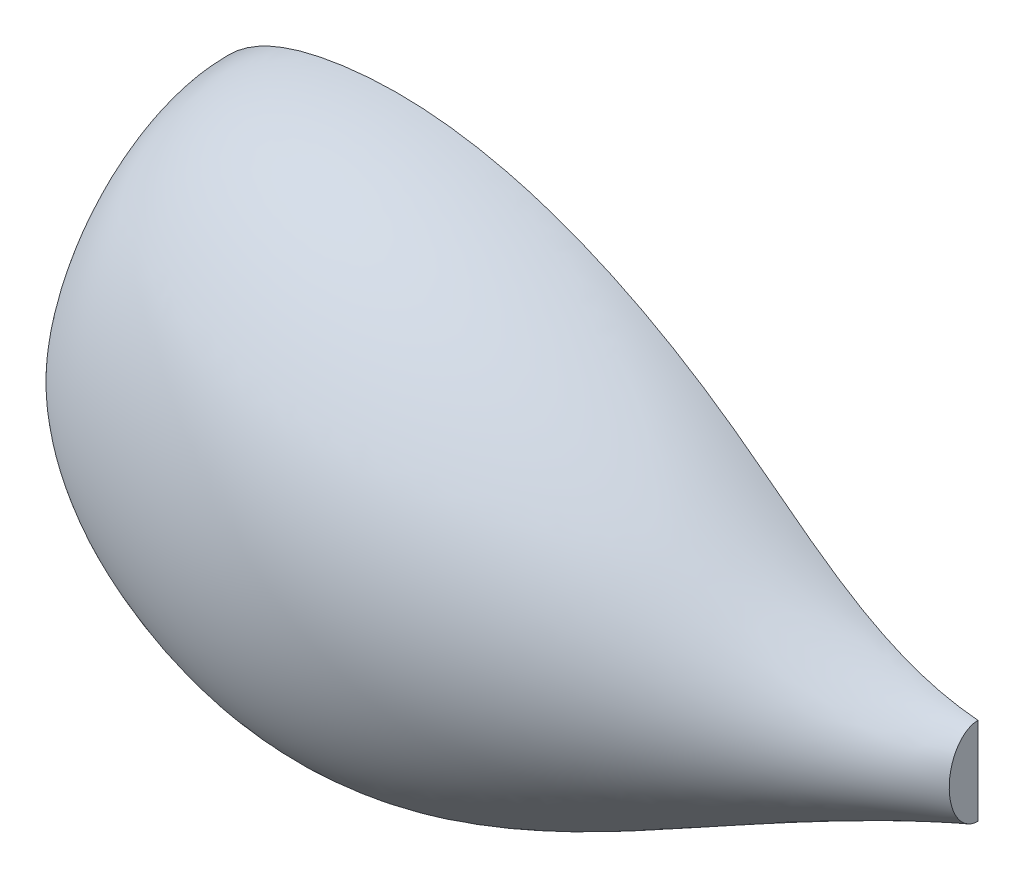
ISO-10303-21;
HEADER;
FILE_DESCRIPTION(('STEP AP214'),'2;1');
FILE_NAME('part.step','',(''),(''),'','','');
FILE_SCHEMA(('AUTOMOTIVE_DESIGN { 1 0 10303 214 1 1 1 1 }'));
ENDSEC;
DATA;
#1=APPLICATION_CONTEXT('core data for automotive mechanical design processes');
#2=APPLICATION_PROTOCOL_DEFINITION('international standard','automotive_design',2000,#1);
#3=PRODUCT_CONTEXT('',#1,'mechanical');
#4=PRODUCT('Part','Part','',(#3));
#5=PRODUCT_RELATED_PRODUCT_CATEGORY('part','',(#4));
#6=PRODUCT_DEFINITION_FORMATION('','',#4);
#7=PRODUCT_DEFINITION_CONTEXT('part definition',#1,'design');
#8=PRODUCT_DEFINITION('design','',#6,#7);
#9=PRODUCT_DEFINITION_SHAPE('','',#8);
#10=(LENGTH_UNIT() NAMED_UNIT(*) SI_UNIT(.MILLI.,.METRE.));
#11=(NAMED_UNIT(*) PLANE_ANGLE_UNIT() SI_UNIT($,.RADIAN.));
#12=(NAMED_UNIT(*) SI_UNIT($,.STERADIAN.) SOLID_ANGLE_UNIT());
#13=UNCERTAINTY_MEASURE_WITH_UNIT(LENGTH_MEASURE(1.E-05),#10,'distance_accuracy_value','');
#14=(GEOMETRIC_REPRESENTATION_CONTEXT(3) GLOBAL_UNCERTAINTY_ASSIGNED_CONTEXT((#13)) GLOBAL_UNIT_ASSIGNED_CONTEXT((#10,
#11,#12)) REPRESENTATION_CONTEXT('',''));
#15=CARTESIAN_POINT('',(0.,0.,0.));
#16=DIRECTION('',(0.,0.,1.));
#17=DIRECTION('',(1.,0.,0.));
#18=AXIS2_PLACEMENT_3D('',#15,#16,#17);
#19=CARTESIAN_POINT('',(0.,0.,0.));
#20=DIRECTION('',(0.,0.,1.));
#21=DIRECTION('',(1.,0.,0.));
#22=AXIS2_PLACEMENT_3D('',#19,#20,#21);
#23=PLANE('',#22);
#24=CARTESIAN_POINT('',(0.,0.,0.));
#25=CARTESIAN_POINT('',(2.74913465416178,5.88162986260912,0.));
#26=CARTESIAN_POINT('',(5.03717500346161,12.96739782815,0.));
#27=CARTESIAN_POINT('',(9.41436775264641,20.1420075056124,0.));
#28=CARTESIAN_POINT('',(10.7979266722041,22.0409358263714,0.));
#29=CARTESIAN_POINT('',(13.7969896713065,24.8764526689348,0.));
#30=CARTESIAN_POINT('',(19.4988240269182,26.5465685835669,0.));
#31=CARTESIAN_POINT('',(25.7105518091795,26.734565554765,0.));
#32=CARTESIAN_POINT('',(30.8570189733681,26.1375032110665,0.));
#33=CARTESIAN_POINT('',(37.3012910290402,24.6226428752955,0.));
#34=CARTESIAN_POINT('',(44.272887864184,21.4438013019915,0.));
#35=CARTESIAN_POINT('',(50.6864894568901,17.2805505945077,0.));
#36=CARTESIAN_POINT('',(58.1055816555101,11.4841674009434,0.));
#37=CARTESIAN_POINT('',(64.0144119849212,7.31487061263528,0.));
#38=CARTESIAN_POINT('',(70.,6.83884738527214,0.));
#39=B_SPLINE_CURVE_WITH_KNOTS('',3,(#24,#25,#26,#27,#28,#29,#30,#31,#32,#33,#34,#35,#36,#37,
#38),.UNSPECIFIED.,.F.,.F.,(4,1,1,1,1,1,1,1,1,1,1,1,4),(0.,0.21875,0.25,0.28125,0.296875,
0.390625,0.46875,0.501412012817861,0.5625,0.6875,0.75,0.8125,1.),.UNSPECIFIED.);
#40=CARTESIAN_POINT('',(0.,0.,0.));
#41=VERTEX_POINT('',#40);
#42=CARTESIAN_POINT('',(70.,6.83884738527214,0.));
#43=VERTEX_POINT('',#42);
#44=EDGE_CURVE('E44',#41,#43,#39,.T.);
#45=ORIENTED_EDGE('',*,*,#44,.T.);
#46=DIRECTION('',(0.,-1.,0.));
#47=VECTOR('',#46,1.);
#48=CARTESIAN_POINT('',(70.,3.41942369263607,0.));
#49=LINE('',#48,#47);
#50=CARTESIAN_POINT('',(70.,0.,0.));
#51=VERTEX_POINT('',#50);
#52=EDGE_CURVE('E70',#43,#51,#49,.T.);
#53=ORIENTED_EDGE('',*,*,#52,.T.);
#54=CARTESIAN_POINT('',(70.,0.,0.));
#55=CARTESIAN_POINT('',(69.5207540377613,-0.167942416323172,0.));
#56=CARTESIAN_POINT('',(69.04310436203,-0.340383935283861,0.));
#57=CARTESIAN_POINT('',(68.0909932436031,-0.693602987996168,0.));
#58=CARTESIAN_POINT('',(67.6165312416867,-0.874379013409343,0.));
#59=CARTESIAN_POINT('',(66.1964012432734,-1.42880153287223,0.));
#60=CARTESIAN_POINT('',(65.255266067126,-1.81409153508852,0.));
#61=CARTESIAN_POINT('',(63.3840383048807,-2.61069819132023,0.));
#62=CARTESIAN_POINT('',(62.4539468575782,-3.02201750218845,0.));
#63=CARTESIAN_POINT('',(60.6030924066511,-3.86595905883859,0.));
#64=CARTESIAN_POINT('',(59.6823330468258,-4.29858926644618,0.));
#65=CARTESIAN_POINT('',(57.8487837652315,-5.18028391161377,0.));
#66=CARTESIAN_POINT('',(56.9359936083618,-5.62934786231631,0.));
#67=CARTESIAN_POINT('',(55.5720550214034,-6.31135182557194,0.));
#68=CARTESIAN_POINT('',(55.1186880010824,-6.53987886238477,0.));
#69=CARTESIAN_POINT('',(54.2131836867605,-6.99934696524036,0.));
#70=CARTESIAN_POINT('',(53.761046382183,-7.23028801043737,0.));
#71=CARTESIAN_POINT('',(52.8575132169115,-7.69349421456996,0.));
#72=CARTESIAN_POINT('',(52.4061172825027,-7.92575923012507,0.));
#73=CARTESIAN_POINT('',(51.5033541313733,-8.39035111627347,0.));
#74=CARTESIAN_POINT('',(51.0519869148511,-8.6226779872467,0.));
#75=CARTESIAN_POINT('',(49.911075319631,-9.20798420555865,0.));
#76=CARTESIAN_POINT('',(49.2211147211035,-9.56015664172984,0.));
#77=CARTESIAN_POINT('',(47.8373167077115,-10.2568725921749,0.));
#78=CARTESIAN_POINT('',(47.1434792335766,-10.6014159894127,0.));
#79=CARTESIAN_POINT('',(45.7493886971919,-11.2777063862241,0.));
#80=CARTESIAN_POINT('',(45.0491344244958,-11.6094509072914,0.));
#81=CARTESIAN_POINT('',(43.6399633735395,-12.2540422041163,0.));
#82=CARTESIAN_POINT('',(42.931047076047,-12.5668900230192,0.));
#83=CARTESIAN_POINT('',(41.6205360861372,-13.1190704049251,0.));
#84=CARTESIAN_POINT('',(41.0204747824398,-13.3620294732587,0.));
#85=CARTESIAN_POINT('',(39.8125159758704,-13.8278091960158,0.));
#86=CARTESIAN_POINT('',(39.2046180845676,-14.050628847783,0.));
#87=CARTESIAN_POINT('',(37.9808755586177,-14.4722301018851,0.));
#88=CARTESIAN_POINT('',(37.3650360174947,-14.6710263387027,0.));
#89=CARTESIAN_POINT('',(36.4350653861802,-14.9481706385443,0.));
#90=CARTESIAN_POINT('',(36.1240498783241,-15.03704125442,0.));
#91=CARTESIAN_POINT('',(35.4999583695043,-15.2072359069124,0.));
#92=CARTESIAN_POINT('',(35.1868824209709,-15.2885601347667,0.));
#93=CARTESIAN_POINT('',(34.6279912596707,-15.4260313104982,0.));
#94=CARTESIAN_POINT('',(34.3825682493245,-15.4837756384748,0.));
#95=CARTESIAN_POINT('',(33.8905982459604,-15.594240229896,0.));
#96=CARTESIAN_POINT('',(33.6440512572462,-15.6469605125608,0.));
#97=CARTESIAN_POINT('',(32.9028660097002,-15.7975814039828,0.));
#98=CARTESIAN_POINT('',(32.4066730423947,-15.8879446207975,0.));
#99=CARTESIAN_POINT('',(31.4109002133468,-16.0483247258914,0.));
#100=CARTESIAN_POINT('',(30.9113195570331,-16.118336659131,0.));
#101=CARTESIAN_POINT('',(29.9096863157605,-16.2376179397327,0.));
#102=CARTESIAN_POINT('',(29.407633778097,-16.2868876824148,0.));
#103=CARTESIAN_POINT('',(28.435788974684,-16.3615489621274,0.));
#104=CARTESIAN_POINT('',(27.9661030138248,-16.3883260418759,0.));
#105=CARTESIAN_POINT('',(27.0260280470074,-16.4227799515731,0.));
#106=CARTESIAN_POINT('',(26.5556390506514,-16.4304570400531,0.));
#107=CARTESIAN_POINT('',(25.61502835814,-16.4262635127152,0.));
#108=CARTESIAN_POINT('',(25.1448066471109,-16.4143964130142,0.));
#109=CARTESIAN_POINT('',(24.2052820444374,-16.3707606899352,0.));
#110=CARTESIAN_POINT('',(23.7359791505948,-16.3389921142274,0.));
#111=CARTESIAN_POINT('',(22.8188523765266,-16.2570340119344,0.));
#112=CARTESIAN_POINT('',(22.3709543180433,-16.2076743108373,0.));
#113=CARTESIAN_POINT('',(21.4776234428911,-16.0902702438384,0.));
#114=CARTESIAN_POINT('',(21.0321905589695,-16.0222263902499,0.));
#115=CARTESIAN_POINT('',(20.1446313109974,-15.867594929299,0.));
#116=CARTESIAN_POINT('',(19.7025044147517,-15.7810103761426,0.));
#117=CARTESIAN_POINT('',(18.8221949247994,-15.5895435383183,0.));
#118=CARTESIAN_POINT('',(18.384012688654,-15.4846596121328,0.));
#119=CARTESIAN_POINT('',(17.5087070211172,-15.2560285458278,0.));
#120=CARTESIAN_POINT('',(17.0716224372953,-15.1321323274455,0.));
#121=CARTESIAN_POINT('',(16.4200626698991,-14.9330151797095,0.));
#122=CARTESIAN_POINT('',(16.203539115086,-14.8644254636404,0.));
#123=CARTESIAN_POINT('',(15.7719221002057,-14.7228842193273,0.));
#124=CARTESIAN_POINT('',(15.5568286400011,-14.649932691503,0.));
#125=CARTESIAN_POINT('',(14.9135837128089,-14.4246888587275,0.));
#126=CARTESIAN_POINT('',(14.4876362429891,-14.2660589768729,0.));
#127=CARTESIAN_POINT('',(13.6419731085253,-13.933053290886,0.));
#128=CARTESIAN_POINT('',(13.2222573871943,-13.7586776300873,0.));
#129=CARTESIAN_POINT('',(12.3877608472906,-13.3945362183092,0.));
#130=CARTESIAN_POINT('',(11.9730032656278,-13.2047172665379,0.));
#131=CARTESIAN_POINT('',(11.1501455604505,-12.8111776681308,0.));
#132=CARTESIAN_POINT('',(10.7420454578368,-12.6074569778617,0.));
#133=CARTESIAN_POINT('',(9.93279644226536,-12.1868478961428,0.));
#134=CARTESIAN_POINT('',(9.53164611363194,-11.9699622279334,0.));
#135=CARTESIAN_POINT('',(8.73645599040318,-11.5235685576526,0.));
#136=CARTESIAN_POINT('',(8.34241611210433,-11.2940607042972,0.));
#137=CARTESIAN_POINT('',(7.23741293654132,-10.6274651562901,0.));
#138=CARTESIAN_POINT('',(6.53492946969027,-10.1762312830483,0.));
#139=CARTESIAN_POINT('',(5.15481518684846,-9.23725675006452,0.));
#140=CARTESIAN_POINT('',(4.47718686650106,-8.74951243927014,0.));
#141=CARTESIAN_POINT('',(3.15230805096635,-7.74535232933599,0.));
#142=CARTESIAN_POINT('',(2.5048542220024,-7.22920405056081,0.));
#143=CARTESIAN_POINT('',(1.23432665725474,-6.16822203519213,0.));
#144=CARTESIAN_POINT('',(0.611242781818308,-5.62340045491692,0.));
#145=CARTESIAN_POINT('',(0.,-5.06581287797937,0.));
#146=B_SPLINE_CURVE_WITH_KNOTS('',3,(#54,#55,#56,#57,#58,#59,#60,#61,#62,#63,#64,#65,#66,#67,
#68,#69,#70,#71,#72,#73,#74,#75,#76,#77,#78,#79,#80,#81,#82,#83,#84,#85,#86,#87,#88,#89,#90,#91,
#92,#93,#94,#95,#96,#97,#98,#99,#100,#101,#102,#103,#104,#105,#106,#107,#108,#109,#110,#111,
#112,#113,#114,#115,#116,#117,#118,#119,#120,#121,#122,#123,#124,#125,#126,#127,#128,#129,#130,
#131,#132,#133,#134,#135,#136,#137,#138,#139,#140,#141,#142,#143,#144,#145),.UNSPECIFIED.,.F.,
.F.,(4,2,2,2,2,2,2,2,2,2,2,2,2,2,2,2,2,2,2,2,2,2,2,2,2,2,2,2,2,2,2,2,2,2,2,2,2,2,2,2,2,2,2,2,2,
4),(0.,1.52340763460116,3.0465406442945,6.0968668432214,9.14750489754901,12.1992914555054,
15.250987675907,16.7741030020044,18.2972051863515,19.8201454453912,21.343095285754,
23.6670040562815,25.9909484529519,28.3153406461096,30.6396044094961,32.5814466758169,
34.523385565049,36.4641354441031,37.4344490845785,38.4047381290485,39.1610597523311,
39.9173784820914,41.4299837520651,42.9429569965275,44.4559014043125,45.8668757926978,
47.2778310824823,48.6885325606621,50.099230659782,51.4506723628006,52.8020770134254,
54.1532592184395,55.504562691587,56.8670613902098,57.548404881333,58.229748306917,
59.5929636367762,60.9561665585556,62.324282448265,63.6924026322665,65.060240771975,
66.4280627991113,68.931469907158,71.4351276918081,73.9182815511856,76.4003910040779),.UNSPECIFIED.);
#147=CARTESIAN_POINT('',(0.,-5.06581287797937,0.));
#148=VERTEX_POINT('',#147);
#149=EDGE_CURVE('E11',#51,#148,#146,.T.);
#150=ORIENTED_EDGE('',*,*,#149,.T.);
#151=DIRECTION('',(0.,-1.,0.));
#152=VECTOR('',#151,1.);
#153=CARTESIAN_POINT('',(0.,-2.53290643898968,0.));
#154=LINE('',#153,#152);
#155=EDGE_CURVE('E51',#41,#148,#154,.T.);
#156=ORIENTED_EDGE('',*,*,#155,.F.);
#157=EDGE_LOOP('',(#45,#53,#150,#156));
#158=FACE_BOUND('',#157,.T.);
#159=ADVANCED_FACE('F34',(#158),#23,.F.);
#160=CARTESIAN_POINT('',(70.,3.41942369263607,0.));
#161=DIRECTION('',(1.,0.,0.));
#162=DIRECTION('',(0.,0.,-1.));
#163=AXIS2_PLACEMENT_3D('',#160,#161,#162);
#164=PLANE('',#163);
#165=ORIENTED_EDGE('',*,*,#52,.F.);
#166=CARTESIAN_POINT('',(70.,3.41942369263607,0.));
#167=DIRECTION('',(1.,0.,0.));
#168=DIRECTION('',(0.,1.,0.));
#169=AXIS2_PLACEMENT_3D('',#166,#167,#168);
#170=ELLIPSE('',#169,3.41942369263607,2.25);
#171=EDGE_CURVE('E67',#43,#51,#170,.T.);
#172=ORIENTED_EDGE('',*,*,#171,.T.);
#173=EDGE_LOOP('',(#165,#172));
#174=FACE_BOUND('',#173,.T.);
#175=ADVANCED_FACE('F74',(#174),#164,.T.);
#176=CARTESIAN_POINT('',(0.,-2.53290643898968,0.));
#177=DIRECTION('',(1.,0.,0.));
#178=DIRECTION('',(0.,0.,-1.));
#179=AXIS2_PLACEMENT_3D('',#176,#177,#178);
#180=PLANE('',#179);
#181=CARTESIAN_POINT('',(0.,-2.53290643898968,0.));
#182=DIRECTION('',(1.,0.,0.));
#183=DIRECTION('',(0.,1.,0.));
#184=AXIS2_PLACEMENT_3D('',#181,#182,#183);
#185=ELLIPSE('',#184,2.53290643898968,2.5);
#186=EDGE_CURVE('E38',#41,#148,#185,.T.);
#187=ORIENTED_EDGE('',*,*,#186,.F.);
#188=ORIENTED_EDGE('',*,*,#155,.T.);
#189=EDGE_LOOP('',(#187,#188));
#190=FACE_BOUND('',#189,.T.);
#191=ADVANCED_FACE('F91',(#190),#180,.F.);
#192=CARTESIAN_POINT('',(0.,0.,0.));
#193=CARTESIAN_POINT('',(2.74913465416178,5.88162986260912,0.));
#194=CARTESIAN_POINT('',(5.03717500346161,12.96739782815,0.));
#195=CARTESIAN_POINT('',(9.41436775264641,20.1420075056124,0.));
#196=CARTESIAN_POINT('',(10.7979266722041,22.0409358263714,0.));
#197=CARTESIAN_POINT('',(13.7969896713065,24.8764526689348,0.));
#198=CARTESIAN_POINT('',(19.4988240269182,26.5465685835669,0.));
#199=CARTESIAN_POINT('',(25.7105518091795,26.734565554765,0.));
#200=CARTESIAN_POINT('',(30.8570189733681,26.1375032110665,0.));
#201=CARTESIAN_POINT('',(37.3012910290402,24.6226428752955,0.));
#202=CARTESIAN_POINT('',(44.272887864184,21.4438013019915,0.));
#203=CARTESIAN_POINT('',(50.6864894568901,17.2805505945077,0.));
#204=CARTESIAN_POINT('',(58.1055816555101,11.4841674009434,0.));
#205=CARTESIAN_POINT('',(64.0144119849212,7.31487061263528,0.));
#206=CARTESIAN_POINT('',(70.,6.83884738527214,0.));
#207=CARTESIAN_POINT('',(0.,0.,0.164703237051049));
#208=CARTESIAN_POINT('',(2.74913465416178,5.88162986260912,0.405401155987693));
#209=CARTESIAN_POINT('',(5.03717500346162,12.96739782815,0.680484491915287));
#210=CARTESIAN_POINT('',(9.41436775264641,20.1420075056124,0.922850830308269));
#211=CARTESIAN_POINT('',(10.7979266722041,22.0409358263714,0.984849224740798));
#212=CARTESIAN_POINT('',(13.7969896713065,24.8764526689348,1.08835809725422));
#213=CARTESIAN_POINT('',(19.4988240269182,26.5465685835669,1.19980855485574));
#214=CARTESIAN_POINT('',(25.7105518091795,26.734565554765,1.26147545698781));
#215=CARTESIAN_POINT('',(30.8570189733681,26.1375032110665,1.27435452469794));
#216=CARTESIAN_POINT('',(37.3012910290402,24.6226428752955,1.24588478977698));
#217=CARTESIAN_POINT('',(44.272887864184,21.4438013019915,1.1247370279085));
#218=CARTESIAN_POINT('',(50.6864894568901,17.2805505945077,0.938632096613125));
#219=CARTESIAN_POINT('',(58.1055816555101,11.4841674009434,0.663154909805604));
#220=CARTESIAN_POINT('',(64.0144119849212,7.31487061263528,0.391357933133625));
#221=CARTESIAN_POINT('',(70.,6.83884738527214,0.18751020062964));
#222=CARTESIAN_POINT('',(0.,-0.033415958399481,0.494068960698842));
#223=CARTESIAN_POINT('',(2.75317818152251,5.77709511280238,1.21604389356127));
#224=CARTESIAN_POINT('',(5.05638749767896,12.7812103312917,2.04115810254689));
#225=CARTESIAN_POINT('',(9.44202139352032,19.8776084359985,2.76812597074791));
#226=CARTESIAN_POINT('',(10.8270126101924,21.7561243484393,2.9540864407317));
#227=CARTESIAN_POINT('',(13.8252445930119,24.5603378697504,3.2645531810931));
#228=CARTESIAN_POINT('',(19.5145068417273,26.2081678152025,3.59883327821562));
#229=CARTESIAN_POINT('',(25.7158365667288,26.3910667583709,3.7837755412602));
#230=CARTESIAN_POINT('',(30.8557394706616,25.7996045062971,3.82237618394956));
#231=CARTESIAN_POINT('',(37.293607962677,24.3021898460362,3.73693490621174));
#232=CARTESIAN_POINT('',(44.2606841472546,21.1650711625532,3.37348379075392));
#233=CARTESIAN_POINT('',(50.6753818961174,17.0574982781886,2.81518183602969));
#234=CARTESIAN_POINT('',(58.1016307148444,11.3375654487618,1.9887801335521));
#235=CARTESIAN_POINT('',(64.0185865142166,7.2244851236472,1.17342966068325));
#236=CARTESIAN_POINT('',(69.9999999999999,6.76545808223477,0.561916806031608));
#237=CARTESIAN_POINT('',(0.,-0.179639739320719,0.968612755393322));
#238=CARTESIAN_POINT('',(2.76985773188557,5.3248698565184,2.36265212374147));
#239=CARTESIAN_POINT('',(5.13563903632561,11.9777258239254,3.95583997328221));
#240=CARTESIAN_POINT('',(9.55609266212537,18.7392097986488,5.35852433078652));
#241=CARTESIAN_POINT('',(10.946992104394,20.5304241785659,5.71723411475763));
#242=CARTESIAN_POINT('',(13.9417961450466,23.2004076502383,6.31594474698964));
#243=CARTESIAN_POINT('',(19.5791984528153,24.7510685533276,6.9599883505625));
#244=CARTESIAN_POINT('',(25.7376361916203,24.9107541744159,7.31466318684443));
#245=CARTESIAN_POINT('',(30.8504615219975,24.3428525140157,7.38658079428589));
#246=CARTESIAN_POINT('',(37.2619153139294,22.9206314292607,7.21761072107231));
#247=CARTESIAN_POINT('',(44.2103438149212,19.9645246122921,6.50997752454616));
#248=CARTESIAN_POINT('',(50.6295632079305,16.0993667421189,5.42512584862319));
#249=CARTESIAN_POINT('',(58.0853330845991,10.7132473014032,3.82026190121401));
#250=CARTESIAN_POINT('',(64.0358064475606,6.84985516951221,2.23781152028013));
#251=CARTESIAN_POINT('',(70.,6.47428385705932,1.05097373457971));
#252=CARTESIAN_POINT('',(0.,-0.417815331687546,1.40426921989629));
#253=CARTESIAN_POINT('',(2.79563521881024,4.61770056404945,3.38405350355391));
#254=CARTESIAN_POINT('',(5.25811868696121,10.7321786634245,5.64666411344832));
#255=CARTESIAN_POINT('',(9.73238462269662,16.9811744899074,7.63718865445883));
#256=CARTESIAN_POINT('',(11.132414959069,18.6388922773219,8.14607147179344));
#257=CARTESIAN_POINT('',(14.1219212709182,21.1040007990971,8.99517378108387));
#258=CARTESIAN_POINT('',(19.6791763972236,22.5079474930438,9.90765737040249));
#259=CARTESIAN_POINT('',(25.7713265209978,22.6355901183971,10.4076158831785));
#260=CARTESIAN_POINT('',(30.8423046922436,22.1073607551172,10.5057144152307));
#261=CARTESIAN_POINT('',(37.2129357658646,20.8055440216792,10.2595807710879));
#262=CARTESIAN_POINT('',(44.1325451194966,18.1340431213446,9.24557436611625));
#263=CARTESIAN_POINT('',(50.5587525080048,14.6484810286321,7.6943268939177));
#264=CARTESIAN_POINT('',(58.0601458378561,9.78449231667697,5.40094663631556));
#265=CARTESIAN_POINT('',(64.0624190718192,6.31202496979851,3.14105732940911));
#266=CARTESIAN_POINT('',(70.,6.0692129668968,1.44614034922928));
#267=CARTESIAN_POINT('',(0.,-0.736275070832584,1.78533985042534));
#268=CARTESIAN_POINT('',(2.82899431953634,3.70526721762814,4.24712076908157));
#269=CARTESIAN_POINT('',(5.41662176425446,9.1378317787804,7.06058467611726));
#270=CARTESIAN_POINT('',(9.96052715990664,14.7378624068286,9.5339878891105));
#271=CARTESIAN_POINT('',(11.3723739474722,16.2265884936762,10.1661440449085));
#272=CARTESIAN_POINT('',(14.3550243749875,18.433058027961,11.2206453064815));
#273=CARTESIAN_POINT('',(19.8085596193993,19.6548441000827,12.3528317809534));
#274=CARTESIAN_POINT('',(25.8149257707806,19.7472749065178,12.9702905266957));
#275=CARTESIAN_POINT('',(30.8317487949153,19.2742457954579,13.0877210038641));
#276=CARTESIAN_POINT('',(37.1495504683693,18.1315492858929,12.7747131852626));
#277=CARTESIAN_POINT('',(44.0318644548298,15.8289296907543,11.5036459195764));
#278=CARTESIAN_POINT('',(50.4671151316308,12.8328744843602,9.56282382193981));
#279=CARTESIAN_POINT('',(58.0275505773654,8.64087884481131,6.69510619930173));
#280=CARTESIAN_POINT('',(64.096858938507,5.66950518744505,3.87090410048053));
#281=CARTESIAN_POINT('',(70.0000000000001,5.59489261976104,1.75275252636463));
#282=CARTESIAN_POINT('',(0.,-1.12335129208846,2.09612614319804));
#283=CARTESIAN_POINT('',(2.86841871130353,2.63791607432653,4.92957986670705));
#284=CARTESIAN_POINT('',(5.60394358287372,7.2893758307831,8.1678126935745));
#285=CARTESIAN_POINT('',(10.2301501584275,12.1453863613048,11.013046072369));
#286=CARTESIAN_POINT('',(11.6559618428577,13.4403737410069,11.7400729195396));
#287=CARTESIAN_POINT('',(14.6305098616148,15.3513437226682,12.952560436908));
#288=CARTESIAN_POINT('',(19.9614670637887,16.3694412927577,14.253423116791));
#289=CARTESIAN_POINT('',(25.8664521568874,16.4284812155325,14.9602145912756));
#290=CARTESIAN_POINT('',(30.8192736435272,16.0247242236427,15.0911790684053));
#291=CARTESIAN_POINT('',(37.0746405713292,15.0719033545493,14.7245067978653));
#292=CARTESIAN_POINT('',(43.9128782147688,13.2007530737919,13.2521422425347));
#293=CARTESIAN_POINT('',(50.3588164140975,10.7739550202513,11.0073218832587));
#294=CARTESIAN_POINT('',(57.9890289058761,7.36140647182271,7.6919013824873));
#295=CARTESIAN_POINT('',(64.1375605991378,4.96665784599017,4.42829091985828));
#296=CARTESIAN_POINT('',(69.9999999999999,5.07914397787338,1.98058307288651));
#297=CARTESIAN_POINT('',(0.,-1.70943086849807,2.40384629918117));
#298=CARTESIAN_POINT('',(2.9270498580342,1.06385273718192,5.58811269957258));
#299=CARTESIAN_POINT('',(5.88252474902538,4.58076333529952,9.22727430001991));
#300=CARTESIAN_POINT('',(10.6311279510995,8.3552427655249,12.4230563499191));
#301=CARTESIAN_POINT('',(12.0777079436873,9.36860121967984,13.2394819391289));
#302=CARTESIAN_POINT('',(15.0402062263425,10.8511364857773,14.6007738110176));
#303=CARTESIAN_POINT('',(20.1888678785215,11.5788291211908,16.0602625514218));
#304=CARTESIAN_POINT('',(25.943081141354,11.5969358976546,16.8503684495389));
#305=CARTESIAN_POINT('',(30.8007208542832,11.3003272854753,16.9930238315597));
#306=CARTESIAN_POINT('',(36.9632361090644,10.63144919192,16.5740442258405));
#307=CARTESIAN_POINT('',(43.7359243192935,9.39644327865077,14.9092537735808));
#308=CARTESIAN_POINT('',(50.1977567828944,7.80538623959791,12.374661737139));
#309=CARTESIAN_POINT('',(57.9317402662256,5.53493243339104,8.63285812287139));
#310=CARTESIAN_POINT('',(64.1980912739224,3.97983257943048,4.95113894899863));
#311=CARTESIAN_POINT('',(70.0000000000001,4.35714594927359,2.18984956859407));
#312=CARTESIAN_POINT('',(0.,-2.53290643898968,2.56422645962417));
#313=CARTESIAN_POINT('',(3.00792040524896,-1.08204540270122,5.9201480788607));
#314=CARTESIAN_POINT('',(6.26677463337259,0.916042550103315,9.75548707227388));
#315=CARTESIAN_POINT('',(11.1842007685783,3.24076875398407,13.1225482603303));
#316=CARTESIAN_POINT('',(12.6594267034524,3.87656481136204,13.9826291316529));
#317=CARTESIAN_POINT('',(15.6053046604499,4.78657654746232,15.4165435846433));
#318=CARTESIAN_POINT('',(20.502524174705,5.13438555570937,16.9533001800652));
#319=CARTESIAN_POINT('',(26.0487762923425,5.10982059272237,17.7835712429719));
#320=CARTESIAN_POINT('',(30.7751308001538,4.96689135649833,17.9312985997131));
#321=CARTESIAN_POINT('',(36.8095747818028,4.69058909685918,17.4857342388887));
#322=CARTESIAN_POINT('',(43.4918499807069,4.32108933985038,15.7253361820841));
#323=CARTESIAN_POINT('',(49.9756055674418,3.86137292176785,13.0472598119104));
#324=CARTESIAN_POINT('',(57.8527214529144,3.13319622316633,9.09454500362324));
#325=CARTESIAN_POINT('',(64.2815818598318,2.7022890449061,5.20622994230937));
#326=CARTESIAN_POINT('',(69.9999999999999,3.41942369263607,2.28999364632396));
#327=CARTESIAN_POINT('',(0.,-3.3563820094813,2.40384629918118));
#328=CARTESIAN_POINT('',(3.08879095246369,-3.22794354258436,5.58811269957258));
#329=CARTESIAN_POINT('',(6.65102451771972,-2.74867823509287,9.22727430001991));
#330=CARTESIAN_POINT('',(11.7372735860569,-1.87370525755672,12.4230563499191));
#331=CARTESIAN_POINT('',(13.2411454632175,-1.61547159695572,13.2394819391289));
#332=CARTESIAN_POINT('',(16.1704030945571,-1.27798339085257,14.6007738110176));
#333=CARTESIAN_POINT('',(20.8161804708882,-1.31005800977205,16.0602625514218));
#334=CARTESIAN_POINT('',(26.1544714433309,-1.37729471220984,16.8503684495389));
#335=CARTESIAN_POINT('',(30.7495407460243,-1.36654457247857,16.9930238315597));
#336=CARTESIAN_POINT('',(36.655913454541,-1.25027099820161,16.5740442258405));
#337=CARTESIAN_POINT('',(43.2477756421204,-0.754264598949965,14.9092537735808));
#338=CARTESIAN_POINT('',(49.7534543519893,-0.0826403960621696,12.374661737139));
#339=CARTESIAN_POINT('',(57.7737026396033,0.731460012941643,8.63285812287139));
#340=CARTESIAN_POINT('',(64.3650724457416,1.42474551038174,4.95113894899864));
#341=CARTESIAN_POINT('',(70.0000000000001,2.48170143599857,2.18984956859407));
#342=CARTESIAN_POINT('',(0.,-3.94246158589091,2.09612614319805));
#343=CARTESIAN_POINT('',(3.14742209919438,-4.80200687972897,4.92957986670705));
#344=CARTESIAN_POINT('',(6.92960568387144,-5.45729073057647,8.16781269357449));
#345=CARTESIAN_POINT('',(12.138251378729,-5.66384885333669,11.013046072369));
#346=CARTESIAN_POINT('',(13.6628915640472,-5.68724411828283,11.7400729195395));
#347=CARTESIAN_POINT('',(16.5800994592849,-5.77819062774358,12.952560436908));
#348=CARTESIAN_POINT('',(21.0435812856212,-6.10067018133893,14.253423116791));
#349=CARTESIAN_POINT('',(26.2311004277975,-6.20884003008772,14.9602145912756));
#350=CARTESIAN_POINT('',(30.7309879567804,-6.09094151064598,15.0911790684053));
#351=CARTESIAN_POINT('',(36.5445089922763,-5.69072516083094,14.7245067978653));
#352=CARTESIAN_POINT('',(43.0708217466451,-4.55857439409112,13.2521422425346));
#353=CARTESIAN_POINT('',(49.5923947207861,-3.05120917671555,11.0073218832587));
#354=CARTESIAN_POINT('',(57.7164139999527,-1.09501402549004,7.69190138248729));
#355=CARTESIAN_POINT('',(64.425603120526,0.437920243822027,4.42829091985828));
#356=CARTESIAN_POINT('',(70.,1.75970340739876,1.98058307288652));
#357=CARTESIAN_POINT('',(0.,-4.32953780714678,1.78533985042534));
#358=CARTESIAN_POINT('',(3.18684649096157,-5.86935802303059,4.24712076908157));
#359=CARTESIAN_POINT('',(7.1169275024907,-7.30574667857377,7.06058467611725));
#360=CARTESIAN_POINT('',(12.4078743772499,-8.25632489886042,9.53398788911048));
#361=CARTESIAN_POINT('',(13.9464794594327,-8.47345887095213,10.1661440449084));
#362=CARTESIAN_POINT('',(16.8555849459123,-8.85990493303641,11.2206453064814));
#363=CARTESIAN_POINT('',(21.1964887300106,-9.38607298866397,12.3528317809534));
#364=CARTESIAN_POINT('',(26.2826268139044,-9.52763372107312,12.9702905266957));
#365=CARTESIAN_POINT('',(30.7185128053923,-9.34046308246121,13.087721003864));
#366=CARTESIAN_POINT('',(36.4695990952362,-8.75037109217452,12.7747131852626));
#367=CARTESIAN_POINT('',(42.9518355065841,-7.18675101105356,11.5036459195764));
#368=CARTESIAN_POINT('',(49.484096003253,-5.11012864082451,9.56282382193979));
#369=CARTESIAN_POINT('',(57.6778923284635,-2.37448639847865,6.69510619930172));
#370=CARTESIAN_POINT('',(64.4663047811568,-0.264927097632851,3.87090410048053));
#371=CARTESIAN_POINT('',(69.9999999999999,1.2439547655111,1.75275252636463));
#372=CARTESIAN_POINT('',(0.,-4.64799754629182,1.40426921989629));
#373=CARTESIAN_POINT('',(3.22020559168763,-6.7817913694519,3.3840535035539));
#374=CARTESIAN_POINT('',(7.27543057978386,-8.90009356321788,5.64666411344831));
#375=CARTESIAN_POINT('',(12.6360169144598,-10.4996369819393,7.63718865445882));
#376=CARTESIAN_POINT('',(14.1864384478357,-10.8857626545978,8.14607147179342));
#377=CARTESIAN_POINT('',(17.0886880499815,-11.5308477041725,8.99517378108385));
#378=CARTESIAN_POINT('',(21.3258719521862,-12.2391763816251,9.90765737040247));
#379=CARTESIAN_POINT('',(26.3262260636871,-12.4159489329524,10.4076158831785));
#380=CARTESIAN_POINT('',(30.7079569080638,-12.1735780421206,10.5057144152306));
#381=CARTESIAN_POINT('',(36.4062137977407,-11.4243658279608,10.2595807710878));
#382=CARTESIAN_POINT('',(42.8511548419172,-9.4918644416438,9.24557436611624));
#383=CARTESIAN_POINT('',(49.3924586268788,-6.92573518509637,7.69432689391769));
#384=CARTESIAN_POINT('',(57.6452970679727,-3.51809987034431,5.40094663631555));
#385=CARTESIAN_POINT('',(64.5007446478447,-0.9074468799863,3.14105732940911));
#386=CARTESIAN_POINT('',(70.0000000000001,0.769634418375345,1.44614034922928));
#387=CARTESIAN_POINT('',(0.,-4.88617313865865,0.968612755393322));
#388=CARTESIAN_POINT('',(3.24598307861236,-7.48896066192085,2.36265212374147));
#389=CARTESIAN_POINT('',(7.39791023041959,-10.1456407237187,3.95583997328222));
#390=CARTESIAN_POINT('',(12.8123088750312,-12.2576722906807,5.35852433078654));
#391=CARTESIAN_POINT('',(14.3718613025109,-12.7772945558418,5.71723411475765));
#392=CARTESIAN_POINT('',(17.2688131758533,-13.6272545553136,6.31594474698966));
#393=CARTESIAN_POINT('',(21.4258498965947,-14.4822974419089,6.95998835056252));
#394=CARTESIAN_POINT('',(26.3599163930647,-14.6911129889711,7.31466318684446));
#395=CARTESIAN_POINT('',(30.6998000783101,-14.409069801019,7.38658079428592));
#396=CARTESIAN_POINT('',(36.3572342496762,-13.5394532355423,7.21761072107233));
#397=CARTESIAN_POINT('',(42.7733561464927,-11.3223459325913,6.50997752454619));
#398=CARTESIAN_POINT('',(49.3216479269533,-8.37662089858312,5.42512584862321));
#399=CARTESIAN_POINT('',(57.6201098212297,-4.44685485507048,3.82026190121403));
#400=CARTESIAN_POINT('',(64.5273572721032,-1.4452770797,2.23781152028014));
#401=CARTESIAN_POINT('',(69.9999999999999,0.364563528212823,1.05097373457972));
#402=CARTESIAN_POINT('',(0.,-5.03239691957989,0.494068960698842));
#403=CARTESIAN_POINT('',(3.26266262897537,-7.94118591820483,1.21604389356126));
#404=CARTESIAN_POINT('',(7.47716176906612,-10.9491252310851,2.04115810254688));
#405=CARTESIAN_POINT('',(12.9263801436361,-13.3960709280303,2.76812597074789));
#406=CARTESIAN_POINT('',(14.4918407967124,-14.0029947257152,2.95408644073168));
#407=CARTESIAN_POINT('',(17.3853647278878,-14.9871847748258,3.26455318109307));
#408=CARTESIAN_POINT('',(21.4905415076824,-15.9393967037837,3.59883327821559));
#409=CARTESIAN_POINT('',(26.381716017956,-16.1714255729261,3.78377554126017));
#410=CARTESIAN_POINT('',(30.6945221296458,-15.8658217933004,3.82237618394953));
#411=CARTESIAN_POINT('',(36.3255416009284,-14.9210116523178,3.73693490621171));
#412=CARTESIAN_POINT('',(42.7230158141592,-12.5228924828524,3.37348379075389));
#413=CARTESIAN_POINT('',(49.2758292387662,-9.33475243465283,2.81518183602967));
#414=CARTESIAN_POINT('',(57.6038121909844,-5.07117300242918,1.98878013355208));
#415=CARTESIAN_POINT('',(64.5445772054473,-1.819907033835,1.17342966068324));
#416=CARTESIAN_POINT('',(70.0000000000002,0.0733893030373738,0.561916806031607));
#417=CARTESIAN_POINT('',(0.,-5.06581287797937,0.164703237051049));
#418=CARTESIAN_POINT('',(3.26670615633612,-8.04572066801156,0.405401155987694));
#419=CARTESIAN_POINT('',(7.49637426328351,-11.1353127279434,0.680484491915288));
#420=CARTESIAN_POINT('',(12.9540337845101,-13.6604699976443,0.922850830308269));
#421=CARTESIAN_POINT('',(14.5209267347007,-14.2878062036473,0.984849224740799));
#422=CARTESIAN_POINT('',(17.4136196495932,-15.3032995740102,1.08835809725422));
#423=CARTESIAN_POINT('',(21.5062243224916,-16.2777974721481,1.19980855485574));
#424=CARTESIAN_POINT('',(26.3870007755054,-16.5149243693202,1.26147545698781));
#425=CARTESIAN_POINT('',(30.6932426269394,-16.2037204980698,1.27435452469794));
#426=CARTESIAN_POINT('',(36.3178585345653,-15.2414646815771,1.24588478977698));
#427=CARTESIAN_POINT('',(42.7108120972299,-12.8016226222907,1.1247370279085));
#428=CARTESIAN_POINT('',(49.2647216779936,-9.55780475097193,0.938632096613126));
#429=CARTESIAN_POINT('',(57.5998612503188,-5.21777495461075,0.663154909805605));
#430=CARTESIAN_POINT('',(64.5487517347426,-1.91029252282308,0.391357933133625));
#431=CARTESIAN_POINT('',(70.,0.,0.18751020062964));
#432=CARTESIAN_POINT('',(0.,-5.06581287797937,-0.164703237051048));
#433=CARTESIAN_POINT('',(3.26670615633612,-8.04572066801156,-0.405401155987692));
#434=CARTESIAN_POINT('',(7.49637426328351,-11.1353127279434,-0.680484491915285));
#435=CARTESIAN_POINT('',(12.9540337845101,-13.6604699976443,-0.922850830308266));
#436=CARTESIAN_POINT('',(14.5209267347007,-14.2878062036473,-0.984849224740796));
#437=CARTESIAN_POINT('',(17.4136196495932,-15.3032995740102,-1.08835809725421));
#438=CARTESIAN_POINT('',(21.5062243224916,-16.2777974721481,-1.19980855485574));
#439=CARTESIAN_POINT('',(26.3870007755054,-16.5149243693202,-1.26147545698781));
#440=CARTESIAN_POINT('',(30.6932426269394,-16.2037204980698,-1.27435452469793));
#441=CARTESIAN_POINT('',(36.3178585345653,-15.2414646815771,-1.24588478977698));
#442=CARTESIAN_POINT('',(42.7108120972299,-12.8016226222907,-1.1247370279085));
#443=CARTESIAN_POINT('',(49.2647216779936,-9.55780475097193,-0.938632096613123));
#444=CARTESIAN_POINT('',(57.5998612503188,-5.21777495461075,-0.663154909805602));
#445=CARTESIAN_POINT('',(64.5487517347426,-1.91029252282308,-0.391357933133623));
#446=CARTESIAN_POINT('',(70.,0.,-0.187510200629639));
#447=CARTESIAN_POINT('',(0.,-5.03239691957989,-0.494068960698843));
#448=CARTESIAN_POINT('',(3.26266262897538,-7.94118591820483,-1.21604389356127));
#449=CARTESIAN_POINT('',(7.47716176906615,-10.9491252310851,-2.04115810254689));
#450=CARTESIAN_POINT('',(12.9263801436361,-13.3960709280303,-2.76812597074791));
#451=CARTESIAN_POINT('',(14.4918407967124,-14.0029947257152,-2.9540864407317));
#452=CARTESIAN_POINT('',(17.3853647278878,-14.9871847748257,-3.2645531810931));
#453=CARTESIAN_POINT('',(21.4905415076825,-15.9393967037837,-3.59883327821562));
#454=CARTESIAN_POINT('',(26.381716017956,-16.1714255729261,-3.7837755412602));
#455=CARTESIAN_POINT('',(30.6945221296458,-15.8658217933004,-3.82237618394956));
#456=CARTESIAN_POINT('',(36.3255416009284,-14.9210116523178,-3.73693490621173));
#457=CARTESIAN_POINT('',(42.7230158141593,-12.5228924828524,-3.37348379075391));
#458=CARTESIAN_POINT('',(49.2758292387662,-9.33475243465282,-2.81518183602969));
#459=CARTESIAN_POINT('',(57.6038121909843,-5.07117300242917,-1.98878013355209));
#460=CARTESIAN_POINT('',(64.5445772054472,-1.819907033835,-1.17342966068324));
#461=CARTESIAN_POINT('',(70.,0.0733893030373731,-0.561916806031603));
#462=CARTESIAN_POINT('',(0.,-4.88617313865865,-0.968612755393323));
#463=CARTESIAN_POINT('',(3.24598307861234,-7.48896066192085,-2.36265212374146));
#464=CARTESIAN_POINT('',(7.39791023041954,-10.1456407237187,-3.9558399732822));
#465=CARTESIAN_POINT('',(12.8123088750311,-12.2576722906807,-5.3585243307865));
#466=CARTESIAN_POINT('',(14.3718613025108,-12.7772945558418,-5.71723411475761));
#467=CARTESIAN_POINT('',(17.2688131758532,-13.6272545553136,-6.31594474698962));
#468=CARTESIAN_POINT('',(21.4258498965946,-14.4822974419089,-6.95998835056247));
#469=CARTESIAN_POINT('',(26.3599163930646,-14.6911129889712,-7.3146631868444));
#470=CARTESIAN_POINT('',(30.69980007831,-14.4090698010191,-7.38658079428586));
#471=CARTESIAN_POINT('',(36.3572342496761,-13.5394532355423,-7.21761072107228));
#472=CARTESIAN_POINT('',(42.7733561464927,-11.3223459325914,-6.50997752454614));
#473=CARTESIAN_POINT('',(49.3216479269533,-8.37662089858314,-5.42512584862317));
#474=CARTESIAN_POINT('',(57.6201098212297,-4.4468548550705,-3.820261901214));
#475=CARTESIAN_POINT('',(64.5273572721033,-1.44527707970001,-2.23781152028012));
#476=CARTESIAN_POINT('',(70.,0.36456352821282,-1.05097373457971));
#477=CARTESIAN_POINT('',(0.,-4.64799754629182,-1.40426921989629));
#478=CARTESIAN_POINT('',(3.22020559168765,-6.7817913694519,-3.38405350355391));
#479=CARTESIAN_POINT('',(7.2754305797839,-8.90009356321788,-5.64666411344834));
#480=CARTESIAN_POINT('',(12.6360169144598,-10.4996369819393,-7.63718865445885));
#481=CARTESIAN_POINT('',(14.1864384478358,-10.8857626545978,-8.14607147179347));
#482=CARTESIAN_POINT('',(17.0886880499815,-11.5308477041725,-8.9951737810839));
#483=CARTESIAN_POINT('',(21.3258719521862,-12.2391763816251,-9.90765737040252));
#484=CARTESIAN_POINT('',(26.3262260636871,-12.4159489329524,-10.4076158831786));
#485=CARTESIAN_POINT('',(30.7079569080639,-12.1735780421206,-10.5057144152307));
#486=CARTESIAN_POINT('',(36.4062137977408,-11.4243658279608,-10.2595807710879));
#487=CARTESIAN_POINT('',(42.8511548419172,-9.49186444164381,-9.24557436611628));
#488=CARTESIAN_POINT('',(49.3924586268788,-6.92573518509638,-7.69432689391772));
#489=CARTESIAN_POINT('',(57.6452970679727,-3.51809987034431,-5.40094663631557));
#490=CARTESIAN_POINT('',(64.5007446478446,-0.907446879986304,-3.14105732940912));
#491=CARTESIAN_POINT('',(70.,0.769634418375342,-1.44614034922927));
#492=CARTESIAN_POINT('',(0.,-4.32953780714678,-1.78533985042534));
#493=CARTESIAN_POINT('',(3.18684649096154,-5.86935802303059,-4.24712076908156));
#494=CARTESIAN_POINT('',(7.11692750249063,-7.30574667857377,-7.06058467611725));
#495=CARTESIAN_POINT('',(12.4078743772498,-8.25632489886042,-9.53398788911048));
#496=CARTESIAN_POINT('',(13.9464794594326,-8.47345887095214,-10.1661440449084));
#497=CARTESIAN_POINT('',(16.8555849459122,-8.85990493303642,-11.2206453064814));
#498=CARTESIAN_POINT('',(21.1964887300105,-9.38607298866398,-12.3528317809534));
#499=CARTESIAN_POINT('',(26.2826268139043,-9.52763372107312,-12.9702905266957));
#500=CARTESIAN_POINT('',(30.7185128053921,-9.34046308246121,-13.087721003864));
#501=CARTESIAN_POINT('',(36.4695990952362,-8.75037109217453,-12.7747131852626));
#502=CARTESIAN_POINT('',(42.9518355065841,-7.18675101105356,-11.5036459195764));
#503=CARTESIAN_POINT('',(49.4840960032529,-5.11012864082452,-9.56282382193979));
#504=CARTESIAN_POINT('',(57.6778923284635,-2.37448639847866,-6.69510619930172));
#505=CARTESIAN_POINT('',(64.4663047811569,-0.264927097632856,-3.87090410048053));
#506=CARTESIAN_POINT('',(70.0000000000001,1.24395476551109,-1.75275252636464));
#507=CARTESIAN_POINT('',(0.,-3.94246158589091,-2.09612614319804));
#508=CARTESIAN_POINT('',(3.14742209919438,-4.80200687972897,-4.92957986670705));
#509=CARTESIAN_POINT('',(6.92960568387144,-5.45729073057647,-8.16781269357448));
#510=CARTESIAN_POINT('',(12.138251378729,-5.66384885333669,-11.013046072369));
#511=CARTESIAN_POINT('',(13.6628915640472,-5.68724411828283,-11.7400729195395));
#512=CARTESIAN_POINT('',(16.580099459285,-5.77819062774358,-12.952560436908));
#513=CARTESIAN_POINT('',(21.0435812856212,-6.10067018133894,-14.253423116791));
#514=CARTESIAN_POINT('',(26.2311004277975,-6.20884003008772,-14.9602145912756));
#515=CARTESIAN_POINT('',(30.7309879567803,-6.09094151064598,-15.0911790684053));
#516=CARTESIAN_POINT('',(36.5445089922763,-5.69072516083095,-14.7245067978653));
#517=CARTESIAN_POINT('',(43.0708217466451,-4.55857439409113,-13.2521422425346));
#518=CARTESIAN_POINT('',(49.5923947207861,-3.05120917671556,-11.0073218832587));
#519=CARTESIAN_POINT('',(57.7164139999526,-1.09501402549004,-7.69190138248729));
#520=CARTESIAN_POINT('',(64.4256031205258,0.437920243822023,-4.42829091985827));
#521=CARTESIAN_POINT('',(69.9999999999999,1.75970340739876,-1.98058307288651));
#522=CARTESIAN_POINT('',(0.,-3.3563820094813,-2.40384629918118));
#523=CARTESIAN_POINT('',(3.08879095246371,-3.22794354258436,-5.58811269957259));
#524=CARTESIAN_POINT('',(6.65102451771977,-2.74867823509287,-9.22727430001992));
#525=CARTESIAN_POINT('',(11.737273586057,-1.87370525755672,-12.4230563499191));
#526=CARTESIAN_POINT('',(13.2411454632175,-1.61547159695572,-13.2394819391289));
#527=CARTESIAN_POINT('',(16.1704030945572,-1.27798339085257,-14.6007738110176));
#528=CARTESIAN_POINT('',(20.8161804708884,-1.31005800977205,-16.0602625514218));
#529=CARTESIAN_POINT('',(26.154471443331,-1.37729471220984,-16.8503684495389));
#530=CARTESIAN_POINT('',(30.7495407460244,-1.36654457247857,-16.9930238315597));
#531=CARTESIAN_POINT('',(36.6559134545412,-1.25027099820161,-16.5740442258405));
#532=CARTESIAN_POINT('',(43.2477756421205,-0.754264598949966,-14.9092537735808));
#533=CARTESIAN_POINT('',(49.7534543519894,-0.0826403960621721,-12.3746617371391));
#534=CARTESIAN_POINT('',(57.7737026396035,0.731460012941638,-8.6328581228714));
#535=CARTESIAN_POINT('',(64.3650724457417,1.42474551038173,-4.95113894899864));
#536=CARTESIAN_POINT('',(70.0000000000002,2.48170143599856,-2.18984956859408));
#537=CARTESIAN_POINT('',(0.,-2.53290643898968,-2.56422645962416));
#538=CARTESIAN_POINT('',(3.00792040524891,-1.08204540270123,-5.92014807886069));
#539=CARTESIAN_POINT('',(6.26677463337247,0.91604255010331,-9.75548707227387));
#540=CARTESIAN_POINT('',(11.1842007685781,3.24076875398406,-13.1225482603303));
#541=CARTESIAN_POINT('',(12.6594267034522,3.87656481136203,-13.9826291316528));
#542=CARTESIAN_POINT('',(15.6053046604497,4.78657654746231,-15.4165435846433));
#543=CARTESIAN_POINT('',(20.5025241747047,5.13438555570936,-16.9533001800652));
#544=CARTESIAN_POINT('',(26.0487762923422,5.10982059272236,-17.7835712429719));
#545=CARTESIAN_POINT('',(30.7751308001535,4.96689135649832,-17.9312985997131));
#546=CARTESIAN_POINT('',(36.8095747818025,4.69058909685916,-17.4857342388886));
#547=CARTESIAN_POINT('',(43.4918499807067,4.32108933985037,-15.7253361820841));
#548=CARTESIAN_POINT('',(49.9756055674416,3.86137292176784,-13.0472598119104));
#549=CARTESIAN_POINT('',(57.8527214529142,3.13319622316632,-9.09454500362323));
#550=CARTESIAN_POINT('',(64.2815818598317,2.70228904490609,-5.20622994230936));
#551=CARTESIAN_POINT('',(69.9999999999998,3.41942369263606,-2.28999364632395));
#552=CARTESIAN_POINT('',(0.,-1.70943086849807,-2.40384629918118));
#553=CARTESIAN_POINT('',(2.92704985803423,1.06385273718192,-5.58811269957259));
#554=CARTESIAN_POINT('',(5.88252474902544,4.58076333529953,-9.22727430001992));
#555=CARTESIAN_POINT('',(10.6311279510996,8.35524276552491,-12.4230563499191));
#556=CARTESIAN_POINT('',(12.0777079436874,9.36860121967986,-13.2394819391289));
#557=CARTESIAN_POINT('',(15.0402062263427,10.8511364857773,-14.6007738110176));
#558=CARTESIAN_POINT('',(20.1888678785217,11.5788291211909,-16.0602625514218));
#559=CARTESIAN_POINT('',(25.9430811413541,11.5969358976547,-16.8503684495389));
#560=CARTESIAN_POINT('',(30.8007208542834,11.3003272854753,-16.9930238315597));
#561=CARTESIAN_POINT('',(36.9632361090646,10.63144919192,-16.5740442258405));
#562=CARTESIAN_POINT('',(43.7359243192937,9.39644327865079,-14.9092537735808));
#563=CARTESIAN_POINT('',(50.1977567828946,7.80538623959793,-12.3746617371391));
#564=CARTESIAN_POINT('',(57.9317402662258,5.53493243339105,-8.6328581228714));
#565=CARTESIAN_POINT('',(64.1980912739225,3.97983257943049,-4.95113894899865));
#566=CARTESIAN_POINT('',(70.0000000000002,4.35714594927358,-2.18984956859408));
#567=CARTESIAN_POINT('',(0.,-1.12335129208846,-2.09612614319805));
#568=CARTESIAN_POINT('',(2.86841871130352,2.63791607432653,-4.92957986670705));
#569=CARTESIAN_POINT('',(5.60394358287369,7.2893758307831,-8.16781269357448));
#570=CARTESIAN_POINT('',(10.2301501584275,12.1453863613048,-11.013046072369));
#571=CARTESIAN_POINT('',(11.6559618428576,13.4403737410069,-11.7400729195395));
#572=CARTESIAN_POINT('',(14.6305098616148,15.3513437226682,-12.952560436908));
#573=CARTESIAN_POINT('',(19.9614670637886,16.3694412927577,-14.253423116791));
#574=CARTESIAN_POINT('',(25.8664521568874,16.4284812155325,-14.9602145912756));
#575=CARTESIAN_POINT('',(30.8192736435271,16.0247242236427,-15.0911790684053));
#576=CARTESIAN_POINT('',(37.0746405713291,15.0719033545493,-14.7245067978653));
#577=CARTESIAN_POINT('',(43.9128782147687,13.2007530737919,-13.2521422425346));
#578=CARTESIAN_POINT('',(50.3588164140975,10.7739550202513,-11.0073218832587));
#579=CARTESIAN_POINT('',(57.989028905876,7.3614064718227,-7.69190138248729));
#580=CARTESIAN_POINT('',(64.1375605991377,4.96665784599017,-4.42829091985827));
#581=CARTESIAN_POINT('',(69.9999999999999,5.07914397787338,-1.98058307288651));
#582=CARTESIAN_POINT('',(0.,-0.736275070832582,-1.78533985042534));
#583=CARTESIAN_POINT('',(2.8289943195363,3.70526721762813,-4.24712076908156));
#584=CARTESIAN_POINT('',(5.41662176425438,9.13783177878039,-7.06058467611724));
#585=CARTESIAN_POINT('',(9.96052715990653,14.7378624068286,-9.53398788911047));
#586=CARTESIAN_POINT('',(11.372373947472,16.2265884936762,-10.1661440449084));
#587=CARTESIAN_POINT('',(14.3550243749874,18.433058027961,-11.2206453064814));
#588=CARTESIAN_POINT('',(19.8085596193991,19.6548441000827,-12.3528317809534));
#589=CARTESIAN_POINT('',(25.8149257707804,19.7472749065178,-12.9702905266957));
#590=CARTESIAN_POINT('',(30.8317487949151,19.2742457954578,-13.087721003864));
#591=CARTESIAN_POINT('',(37.1495504683691,18.1315492858929,-12.7747131852625));
#592=CARTESIAN_POINT('',(44.0318644548297,15.8289296907543,-11.5036459195764));
#593=CARTESIAN_POINT('',(50.4671151316307,12.8328744843602,-9.56282382193978));
#594=CARTESIAN_POINT('',(58.0275505773654,8.64087884481131,-6.69510619930172));
#595=CARTESIAN_POINT('',(64.0968589385071,5.66950518744505,-3.87090410048053));
#596=CARTESIAN_POINT('',(70.0000000000001,5.59489261976104,-1.75275252636464));
#597=CARTESIAN_POINT('',(0.,-0.417815331687545,-1.40426921989629));
#598=CARTESIAN_POINT('',(2.79563521881028,4.61770056404946,-3.3840535035539));
#599=CARTESIAN_POINT('',(5.25811868696129,10.7321786634245,-5.64666411344832));
#600=CARTESIAN_POINT('',(9.73238462269673,16.9811744899074,-7.63718865445883));
#601=CARTESIAN_POINT('',(11.1324149590691,18.6388922773219,-8.14607147179344));
#602=CARTESIAN_POINT('',(14.1219212709183,21.1040007990972,-8.99517378108387));
#603=CARTESIAN_POINT('',(19.6791763972237,22.5079474930438,-9.90765737040249));
#604=CARTESIAN_POINT('',(25.7713265209979,22.6355901183972,-10.4076158831785));
#605=CARTESIAN_POINT('',(30.8423046922437,22.1073607551173,-10.5057144152307));
#606=CARTESIAN_POINT('',(37.2129357658648,20.8055440216792,-10.2595807710879));
#607=CARTESIAN_POINT('',(44.1325451194967,18.1340431213446,-9.24557436611625));
#608=CARTESIAN_POINT('',(50.5587525080049,14.6484810286321,-7.6943268939177));
#609=CARTESIAN_POINT('',(58.0601458378561,9.78449231667698,-5.40094663631556));
#610=CARTESIAN_POINT('',(64.0624190718191,6.3120249697985,-3.14105732940911));
#611=CARTESIAN_POINT('',(69.9999999999998,6.06921296689679,-1.44614034922928));
#612=CARTESIAN_POINT('',(0.,-0.179639739320719,-0.968612755393322));
#613=CARTESIAN_POINT('',(2.76985773188554,5.3248698565184,-2.36265212374148));
#614=CARTESIAN_POINT('',(5.13563903632555,11.9777258239254,-3.95583997328222));
#615=CARTESIAN_POINT('',(9.5560926621253,18.7392097986488,-5.35852433078653));
#616=CARTESIAN_POINT('',(10.9469921043939,20.5304241785659,-5.71723411475765));
#617=CARTESIAN_POINT('',(13.9417961450465,23.2004076502382,-6.31594474698966));
#618=CARTESIAN_POINT('',(19.5791984528151,24.7510685533276,-6.95998835056252));
#619=CARTESIAN_POINT('',(25.7376361916202,24.9107541744159,-7.31466318684445));
#620=CARTESIAN_POINT('',(30.8504615219974,24.3428525140157,-7.38658079428591));
#621=CARTESIAN_POINT('',(37.2619153139293,22.9206314292607,-7.21761072107233));
#622=CARTESIAN_POINT('',(44.2103438149212,19.9645246122921,-6.50997752454618));
#623=CARTESIAN_POINT('',(50.6295632079304,16.0993667421188,-5.42512584862321));
#624=CARTESIAN_POINT('',(58.0853330845992,10.7132473014032,-3.82026190121403));
#625=CARTESIAN_POINT('',(64.0358064475606,6.84985516951221,-2.23781152028014));
#626=CARTESIAN_POINT('',(70.0000000000001,6.47428385705932,-1.05097373457972));
#627=CARTESIAN_POINT('',(0.,-0.0334159583994815,-0.494068960698843));
#628=CARTESIAN_POINT('',(2.75317818152252,5.77709511280239,-1.21604389356126));
#629=CARTESIAN_POINT('',(5.05638749767898,12.7812103312917,-2.04115810254688));
#630=CARTESIAN_POINT('',(9.44202139352036,19.8776084359985,-2.76812597074789));
#631=CARTESIAN_POINT('',(10.8270126101924,21.7561243484393,-2.95408644073168));
#632=CARTESIAN_POINT('',(13.8252445930119,24.5603378697504,-3.26455318109307));
#633=CARTESIAN_POINT('',(19.5145068417274,26.2081678152025,-3.59883327821559));
#634=CARTESIAN_POINT('',(25.7158365667289,26.3910667583709,-3.78377554126017));
#635=CARTESIAN_POINT('',(30.8557394706616,25.7996045062971,-3.82237618394953));
#636=CARTESIAN_POINT('',(37.2936079626771,24.3021898460362,-3.7369349062117));
#637=CARTESIAN_POINT('',(44.2606841472546,21.1650711625532,-3.37348379075388));
#638=CARTESIAN_POINT('',(50.6753818961175,17.0574982781886,-2.81518183602967));
#639=CARTESIAN_POINT('',(58.1016307148445,11.3375654487619,-1.98878013355208));
#640=CARTESIAN_POINT('',(64.0185865142166,7.2244851236472,-1.17342966068324));
#641=CARTESIAN_POINT('',(69.9999999999999,6.76545808223477,-0.561916806031609));
#642=CARTESIAN_POINT('',(0.,0.,-0.164703237051049));
#643=CARTESIAN_POINT('',(2.74913465416178,5.88162986260912,-0.405401155987693));
#644=CARTESIAN_POINT('',(5.03717500346161,12.96739782815,-0.680484491915287));
#645=CARTESIAN_POINT('',(9.41436775264641,20.1420075056124,-0.922850830308269));
#646=CARTESIAN_POINT('',(10.7979266722041,22.0409358263714,-0.984849224740799));
#647=CARTESIAN_POINT('',(13.7969896713065,24.8764526689348,-1.08835809725422));
#648=CARTESIAN_POINT('',(19.4988240269182,26.5465685835669,-1.19980855485574));
#649=CARTESIAN_POINT('',(25.7105518091795,26.734565554765,-1.26147545698781));
#650=CARTESIAN_POINT('',(30.8570189733681,26.1375032110665,-1.27435452469794));
#651=CARTESIAN_POINT('',(37.3012910290402,24.6226428752955,-1.24588478977698));
#652=CARTESIAN_POINT('',(44.272887864184,21.4438013019915,-1.1247370279085));
#653=CARTESIAN_POINT('',(50.6864894568901,17.2805505945077,-0.938632096613125));
#654=CARTESIAN_POINT('',(58.1055816555101,11.4841674009434,-0.663154909805604));
#655=CARTESIAN_POINT('',(64.0144119849212,7.31487061263528,-0.391357933133625));
#656=CARTESIAN_POINT('',(70.,6.83884738527214,-0.18751020062964));
#657=CARTESIAN_POINT('',(0.,0.,0.));
#658=CARTESIAN_POINT('',(2.74913465416178,5.88162986260912,0.));
#659=CARTESIAN_POINT('',(5.03717500346161,12.96739782815,0.));
#660=CARTESIAN_POINT('',(9.41436775264641,20.1420075056124,0.));
#661=CARTESIAN_POINT('',(10.7979266722041,22.0409358263714,0.));
#662=CARTESIAN_POINT('',(13.7969896713065,24.8764526689348,0.));
#663=CARTESIAN_POINT('',(19.4988240269182,26.5465685835669,0.));
#664=CARTESIAN_POINT('',(25.7105518091795,26.734565554765,0.));
#665=CARTESIAN_POINT('',(30.8570189733681,26.1375032110665,0.));
#666=CARTESIAN_POINT('',(37.3012910290402,24.6226428752955,0.));
#667=CARTESIAN_POINT('',(44.272887864184,21.4438013019915,0.));
#668=CARTESIAN_POINT('',(50.6864894568901,17.2805505945077,0.));
#669=CARTESIAN_POINT('',(58.1055816555101,11.4841674009434,0.));
#670=CARTESIAN_POINT('',(64.0144119849212,7.31487061263528,0.));
#671=CARTESIAN_POINT('',(70.,6.83884738527214,0.));
#672=B_SPLINE_SURFACE_WITH_KNOTS('',3,3,((#192,#193,#194,#195,#196,#197,#198,#199,#200,#201,
#202,#203,#204,#205,#206),(#207,#208,#209,#210,#211,#212,#213,#214,#215,#216,#217,#218,#219,
#220,#221),(#222,#223,#224,#225,#226,#227,#228,#229,#230,#231,#232,#233,#234,#235,#236),(#237,
#238,#239,#240,#241,#242,#243,#244,#245,#246,#247,#248,#249,#250,#251),(#252,#253,#254,#255,
#256,#257,#258,#259,#260,#261,#262,#263,#264,#265,#266),(#267,#268,#269,#270,#271,#272,#273,
#274,#275,#276,#277,#278,#279,#280,#281),(#282,#283,#284,#285,#286,#287,#288,#289,#290,#291,
#292,#293,#294,#295,#296),(#297,#298,#299,#300,#301,#302,#303,#304,#305,#306,#307,#308,#309,
#310,#311),(#312,#313,#314,#315,#316,#317,#318,#319,#320,#321,#322,#323,#324,#325,#326),(#327,
#328,#329,#330,#331,#332,#333,#334,#335,#336,#337,#338,#339,#340,#341),(#342,#343,#344,#345,
#346,#347,#348,#349,#350,#351,#352,#353,#354,#355,#356),(#357,#358,#359,#360,#361,#362,#363,
#364,#365,#366,#367,#368,#369,#370,#371),(#372,#373,#374,#375,#376,#377,#378,#379,#380,#381,
#382,#383,#384,#385,#386),(#387,#388,#389,#390,#391,#392,#393,#394,#395,#396,#397,#398,#399,
#400,#401),(#402,#403,#404,#405,#406,#407,#408,#409,#410,#411,#412,#413,#414,#415,#416),(#417,
#418,#419,#420,#421,#422,#423,#424,#425,#426,#427,#428,#429,#430,#431),(#432,#433,#434,#435,
#436,#437,#438,#439,#440,#441,#442,#443,#444,#445,#446),(#447,#448,#449,#450,#451,#452,#453,
#454,#455,#456,#457,#458,#459,#460,#461),(#462,#463,#464,#465,#466,#467,#468,#469,#470,#471,
#472,#473,#474,#475,#476),(#477,#478,#479,#480,#481,#482,#483,#484,#485,#486,#487,#488,#489,
#490,#491),(#492,#493,#494,#495,#496,#497,#498,#499,#500,#501,#502,#503,#504,#505,#506),(#507,
#508,#509,#510,#511,#512,#513,#514,#515,#516,#517,#518,#519,#520,#521),(#522,#523,#524,#525,
#526,#527,#528,#529,#530,#531,#532,#533,#534,#535,#536),(#537,#538,#539,#540,#541,#542,#543,
#544,#545,#546,#547,#548,#549,#550,#551),(#552,#553,#554,#555,#556,#557,#558,#559,#560,#561,
#562,#563,#564,#565,#566),(#567,#568,#569,#570,#571,#572,#573,#574,#575,#576,#577,#578,#579,
#580,#581),(#582,#583,#584,#585,#586,#587,#588,#589,#590,#591,#592,#593,#594,#595,#596),(#597,
#598,#599,#600,#601,#602,#603,#604,#605,#606,#607,#608,#609,#610,#611),(#612,#613,#614,#615,
#616,#617,#618,#619,#620,#621,#622,#623,#624,#625,#626),(#627,#628,#629,#630,#631,#632,#633,
#634,#635,#636,#637,#638,#639,#640,#641),(#642,#643,#644,#645,#646,#647,#648,#649,#650,#651,
#652,#653,#654,#655,#656),(#657,#658,#659,#660,#661,#662,#663,#664,#665,#666,#667,#668,#669,
#670,#671)),.UNSPECIFIED.,.T.,.F.,.F.,(4,1,1,1,1,1,1,1,1,1,1,1,1,1,2,1,1,1,1,1,1,1,1,1,1,1,1,1,
4),(4,1,1,1,1,1,1,1,1,1,1,1,4),(0.,0.03125,0.0625,0.09375,0.125,0.15625,0.1875,0.25,0.3125,
0.34375,0.375,0.40625,0.4375,0.46875,0.5,0.53125,0.5625,0.59375,0.625,0.65625,0.6875,0.75,
0.8125,0.84375,0.875,0.90625,0.9375,0.96875,1.),(0.,0.21875,0.25,0.28125,0.296875,0.390625,
0.46875,0.501412012817861,0.5625,0.6875,0.75,0.8125,1.),.UNSPECIFIED.);
#673=ORIENTED_EDGE('',*,*,#44,.F.);
#674=ORIENTED_EDGE('',*,*,#186,.T.);
#675=ORIENTED_EDGE('',*,*,#149,.F.);
#676=ORIENTED_EDGE('',*,*,#171,.F.);
#677=EDGE_LOOP('',(#673,#674,#675,#676));
#678=FACE_BOUND('',#677,.T.);
#679=ADVANCED_FACE('F65',(#678),#672,.T.);
#680=CLOSED_SHELL('',(#159,#175,#191,#679));
#681=MANIFOLD_SOLID_BREP('B2',#680);
#682=ADVANCED_BREP_SHAPE_REPRESENTATION('',(#18,#681),#14);
#683=SHAPE_DEFINITION_REPRESENTATION(#9,#682);
ENDSEC;
END-ISO-10303-21;
